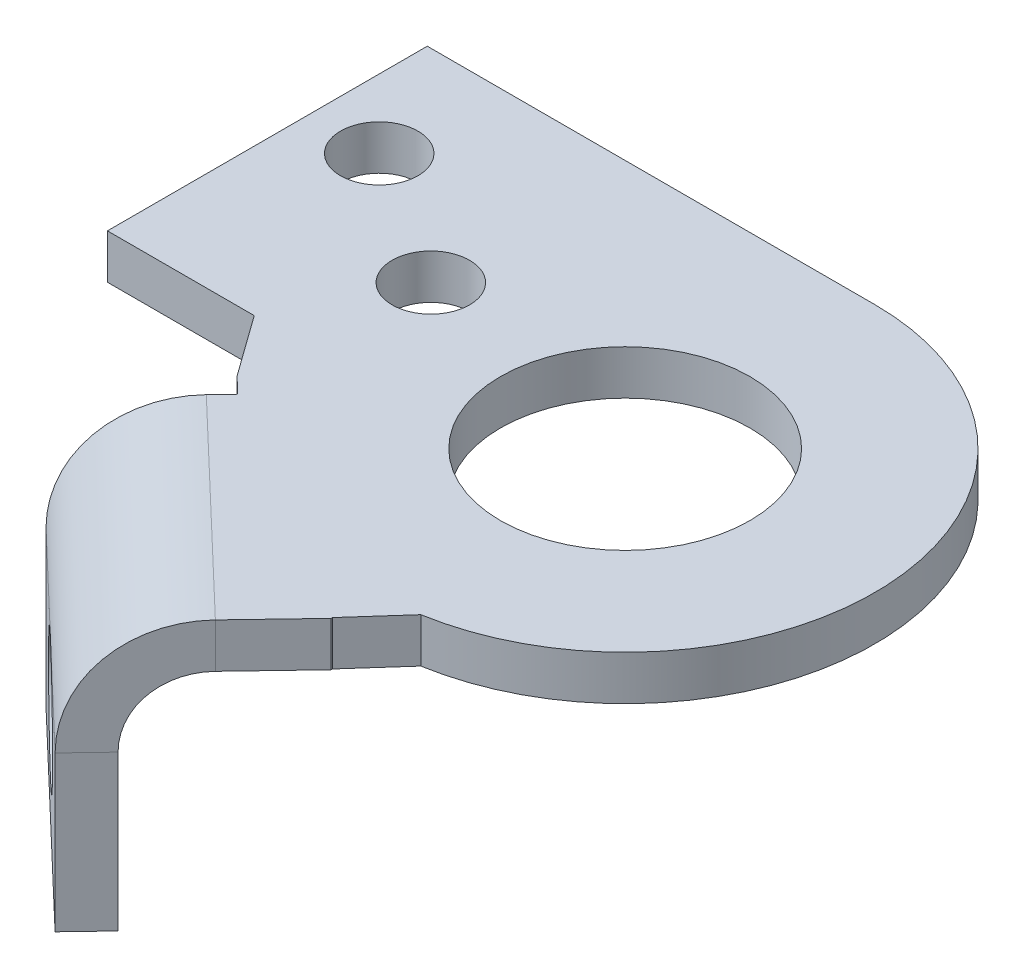
ISO-10303-21;
HEADER;
FILE_DESCRIPTION(('STEP AP214'),'2;1');
FILE_NAME('part.step','',(''),(''),'','','');
FILE_SCHEMA(('AUTOMOTIVE_DESIGN { 1 0 10303 214 1 1 1 1 }'));
ENDSEC;
DATA;
#1=APPLICATION_CONTEXT('core data for automotive mechanical design processes');
#2=APPLICATION_PROTOCOL_DEFINITION('international standard','automotive_design',2000,#1);
#3=PRODUCT_CONTEXT('',#1,'mechanical');
#4=PRODUCT('Part','Part','',(#3));
#5=PRODUCT_RELATED_PRODUCT_CATEGORY('part','',(#4));
#6=PRODUCT_DEFINITION_FORMATION('','',#4);
#7=PRODUCT_DEFINITION_CONTEXT('part definition',#1,'design');
#8=PRODUCT_DEFINITION('design','',#6,#7);
#9=PRODUCT_DEFINITION_SHAPE('','',#8);
#10=(LENGTH_UNIT() NAMED_UNIT(*) SI_UNIT(.MILLI.,.METRE.));
#11=(NAMED_UNIT(*) PLANE_ANGLE_UNIT() SI_UNIT($,.RADIAN.));
#12=(NAMED_UNIT(*) SI_UNIT($,.STERADIAN.) SOLID_ANGLE_UNIT());
#13=UNCERTAINTY_MEASURE_WITH_UNIT(LENGTH_MEASURE(1.E-05),#10,'distance_accuracy_value','');
#14=(GEOMETRIC_REPRESENTATION_CONTEXT(3) GLOBAL_UNCERTAINTY_ASSIGNED_CONTEXT((#13)) GLOBAL_UNIT_ASSIGNED_CONTEXT((#10,
#11,#12)) REPRESENTATION_CONTEXT('',''));
#15=CARTESIAN_POINT('',(0.,0.,0.));
#16=DIRECTION('',(0.,0.,1.));
#17=DIRECTION('',(1.,0.,0.));
#18=AXIS2_PLACEMENT_3D('',#15,#16,#17);
#19=CARTESIAN_POINT('',(-14.9268849894224,0.,7.62861644467929));
#20=DIRECTION('',(-0.690458508800279,0.,0.723371998093163));
#21=DIRECTION('',(0.723371998093163,0.,0.690458508800279));
#22=AXIS2_PLACEMENT_3D('',#19,#20,#21);
#23=PLANE('',#22);
#24=DIRECTION('',(0.723371998093163,0.,0.690458508800279));
#25=VECTOR('',#24,1.);
#26=CARTESIAN_POINT('',(-10.926314141485,2.588,11.4471609685178));
#27=LINE('',#26,#25);
#28=CARTESIAN_POINT('',(-14.9268849894224,2.588,7.62861644467929));
#29=VERTEX_POINT('',#28);
#30=CARTESIAN_POINT('',(-13.9908416238899,2.588,8.52206975506685));
#31=VERTEX_POINT('',#30);
#32=EDGE_CURVE('E216',#29,#31,#27,.T.);
#33=ORIENTED_EDGE('',*,*,#32,.F.);
#34=DIRECTION('',(0.,1.,0.));
#35=VECTOR('',#34,1.);
#36=CARTESIAN_POINT('',(-14.9268849894224,0.,7.62861644467929));
#37=LINE('',#36,#35);
#38=CARTESIAN_POINT('',(-14.9268849894224,0.,7.62861644467929));
#39=VERTEX_POINT('',#38);
#40=EDGE_CURVE('E324',#39,#29,#37,.T.);
#41=ORIENTED_EDGE('',*,*,#40,.F.);
#42=DIRECTION('',(0.723371998093163,0.,0.690458508800279));
#43=VECTOR('',#42,1.);
#44=CARTESIAN_POINT('',(-14.9268849894224,0.,7.62861644467929));
#45=LINE('',#44,#43);
#46=CARTESIAN_POINT('',(-13.9908416238899,0.,8.52206975506685));
#47=VERTEX_POINT('',#46);
#48=EDGE_CURVE('E321',#39,#47,#45,.T.);
#49=ORIENTED_EDGE('',*,*,#48,.T.);
#50=DIRECTION('',(0.,1.,0.));
#51=VECTOR('',#50,1.);
#52=CARTESIAN_POINT('',(-13.9908416238899,0.,8.52206975506685));
#53=LINE('',#52,#51);
#54=EDGE_CURVE('E328',#47,#31,#53,.T.);
#55=ORIENTED_EDGE('',*,*,#54,.T.);
#56=EDGE_LOOP('',(#33,#41,#49,#55));
#57=FACE_BOUND('',#56,.T.);
#58=ADVANCED_FACE('F61',(#57),#23,.T.);
#59=CARTESIAN_POINT('',(-13.9908416238899,0.,8.52206975506685));
#60=DIRECTION('',(-0.723371998093163,0.,-0.690458508800279));
#61=DIRECTION('',(-0.690458508800279,0.,0.723371998093163));
#62=AXIS2_PLACEMENT_3D('',#59,#60,#61);
#63=PLANE('',#62);
#64=DIRECTION('',(-0.690458508800279,0.,0.723371998093163));
#65=VECTOR('',#64,1.);
#66=CARTESIAN_POINT('',(-3.06452748240491,2.588,-2.92509121345095));
#67=LINE('',#66,#65);
#68=CARTESIAN_POINT('',(-14.8842949342774,2.58799999999998,9.45811312059941));
#69=VERTEX_POINT('',#68);
#70=EDGE_CURVE('E213',#31,#69,#67,.T.);
#71=ORIENTED_EDGE('',*,*,#70,.F.);
#72=ORIENTED_EDGE('',*,*,#54,.F.);
#73=DIRECTION('',(-0.690458508800279,0.,0.723371998093163));
#74=VECTOR('',#73,1.);
#75=CARTESIAN_POINT('',(-13.9908416238899,0.,8.52206975506685));
#76=LINE('',#75,#74);
#77=CARTESIAN_POINT('',(-14.8842949342774,0.,9.45811312059941));
#78=VERTEX_POINT('',#77);
#79=EDGE_CURVE('E325',#47,#78,#76,.T.);
#80=ORIENTED_EDGE('',*,*,#79,.T.);
#81=DIRECTION('',(0.,1.,0.));
#82=VECTOR('',#81,1.);
#83=CARTESIAN_POINT('',(-14.8842949342774,0.,9.45811312059941));
#84=LINE('',#83,#82);
#85=EDGE_CURVE('E305',#78,#69,#84,.T.);
#86=ORIENTED_EDGE('',*,*,#85,.T.);
#87=EDGE_LOOP('',(#71,#72,#80,#86));
#88=FACE_BOUND('',#87,.T.);
#89=ADVANCED_FACE('F347',(#88),#63,.T.);
#90=CARTESIAN_POINT('',(-3.2840455781067,0.,20.530550114686));
#91=DIRECTION('',(0.723371998093163,0.,0.690458508800279));
#92=DIRECTION('',(0.690458508800279,0.,-0.723371998093163));
#93=AXIS2_PLACEMENT_3D('',#90,#91,#92);
#94=PLANE('',#93);
#95=DIRECTION('',(0.,1.,0.));
#96=VECTOR('',#95,1.);
#97=CARTESIAN_POINT('',(0.,-13.,17.0899572602481));
#98=LINE('',#97,#96);
#99=CARTESIAN_POINT('',(0.,0.,17.0899572602481));
#100=VERTEX_POINT('',#99);
#101=CARTESIAN_POINT('',(0.,2.588,17.0899572602481));
#102=VERTEX_POINT('',#101);
#103=EDGE_CURVE('E254',#100,#102,#98,.T.);
#104=ORIENTED_EDGE('',*,*,#103,.T.);
#105=DIRECTION('',(0.690458508800279,0.,-0.723371998093163));
#106=VECTOR('',#105,1.);
#107=CARTESIAN_POINT('',(8.53572187376583,2.588,8.1473457806356));
#108=LINE('',#107,#106);
#109=CARTESIAN_POINT('',(-3.2840455781067,2.588,20.530550114686));
#110=VERTEX_POINT('',#109);
#111=EDGE_CURVE('E210',#110,#102,#108,.T.);
#112=ORIENTED_EDGE('',*,*,#111,.F.);
#113=DIRECTION('',(0.,1.,0.));
#114=VECTOR('',#113,1.);
#115=CARTESIAN_POINT('',(-3.2840455781067,0.,20.530550114686));
#116=LINE('',#115,#114);
#117=CARTESIAN_POINT('',(-3.2840455781067,0.,20.530550114686));
#118=VERTEX_POINT('',#117);
#119=EDGE_CURVE('E315',#118,#110,#116,.T.);
#120=ORIENTED_EDGE('',*,*,#119,.F.);
#121=DIRECTION('',(0.690458508800279,0.,-0.723371998093163));
#122=VECTOR('',#121,1.);
#123=CARTESIAN_POINT('',(-3.2840455781067,0.,20.530550114686));
#124=LINE('',#123,#122);
#125=EDGE_CURVE('E318',#118,#100,#124,.T.);
#126=ORIENTED_EDGE('',*,*,#125,.T.);
#127=EDGE_LOOP('',(#104,#112,#120,#126));
#128=FACE_BOUND('',#127,.T.);
#129=ADVANCED_FACE('F381',(#128),#94,.T.);
#130=CARTESIAN_POINT('',(0.,0.,0.));
#131=DIRECTION('',(0.,1.,0.));
#132=DIRECTION('',(0.,0.,1.));
#133=AXIS2_PLACEMENT_3D('',#130,#131,#132);
#134=PLANE('',#133);
#135=CARTESIAN_POINT('',(0.,0.,0.));
#136=DIRECTION('',(0.,1.,0.));
#137=DIRECTION('',(0.,0.,1.));
#138=AXIS2_PLACEMENT_3D('',#135,#136,#137);
#139=CIRCLE('',#138,7.25);
#140=CARTESIAN_POINT('',(0.,0.,7.25));
#141=VERTEX_POINT('',#140);
#142=EDGE_CURVE('E234',#141,#141,#139,.T.);
#143=ORIENTED_EDGE('',*,*,#142,.T.);
#144=EDGE_LOOP('',(#143));
#145=FACE_BOUND('',#144,.T.);
#146=DIRECTION('',(1.,0.,0.));
#147=VECTOR('',#146,1.);
#148=CARTESIAN_POINT('',(0.,0.,4.086));
#149=LINE('',#148,#147);
#150=CARTESIAN_POINT('',(-26.,0.,4.086));
#151=VERTEX_POINT('',#150);
#152=CARTESIAN_POINT('',(-17.4700945052539,0.,4.086));
#153=VERTEX_POINT('',#152);
#154=EDGE_CURVE('E211',#151,#153,#149,.T.);
#155=ORIENTED_EDGE('',*,*,#154,.F.);
#156=DIRECTION('',(0.,0.,-1.));
#157=VECTOR('',#156,1.);
#158=CARTESIAN_POINT('',(-26.,0.,0.));
#159=LINE('',#158,#157);
#160=CARTESIAN_POINT('',(-26.,0.,-14.5));
#161=VERTEX_POINT('',#160);
#162=EDGE_CURVE('E175',#151,#161,#159,.T.);
#163=ORIENTED_EDGE('',*,*,#162,.T.);
#164=DIRECTION('',(-1.,0.,0.));
#165=VECTOR('',#164,1.);
#166=CARTESIAN_POINT('',(0.,0.,-14.5));
#167=LINE('',#166,#165);
#168=CARTESIAN_POINT('',(0.,0.,-14.5));
#169=VERTEX_POINT('',#168);
#170=EDGE_CURVE('E195',#169,#161,#167,.T.);
#171=ORIENTED_EDGE('',*,*,#170,.F.);
#172=CARTESIAN_POINT('',(0.,0.,0.));
#173=DIRECTION('',(0.,1.,0.));
#174=DIRECTION('',(0.,0.,1.));
#175=AXIS2_PLACEMENT_3D('',#172,#173,#174);
#176=CIRCLE('',#175,14.5);
#177=CARTESIAN_POINT('',(2.42132895642929,0.,14.2964039564066));
#178=VERTEX_POINT('',#177);
#179=EDGE_CURVE('E199',#178,#169,#176,.T.);
#180=ORIENTED_EDGE('',*,*,#179,.F.);
#181=DIRECTION('',(-0.665811178859835,0.,0.74612028125851));
#182=VECTOR('',#181,1.);
#183=CARTESIAN_POINT('',(-1.09894578486608,0.,18.2412887277622));
#184=LINE('',#183,#182);
#185=CARTESIAN_POINT('',(0.,0.,17.0097898221772));
#186=VERTEX_POINT('',#185);
#187=EDGE_CURVE('E231',#178,#186,#184,.T.);
#188=ORIENTED_EDGE('',*,*,#187,.T.);
#189=DIRECTION('',(0.,0.,-1.));
#190=VECTOR('',#189,1.);
#191=CARTESIAN_POINT('',(0.,0.,0.));
#192=LINE('',#191,#190);
#193=EDGE_CURVE('E334',#100,#186,#192,.T.);
#194=ORIENTED_EDGE('',*,*,#193,.F.);
#195=ORIENTED_EDGE('',*,*,#125,.F.);
#196=DIRECTION('',(-0.723371998093163,0.,-0.690458508800279));
#197=VECTOR('',#196,1.);
#198=CARTESIAN_POINT('',(-14.8842949342775,0.,9.45811312059939));
#199=LINE('',#198,#197);
#200=EDGE_CURVE('E311',#78,#118,#199,.F.);
#201=ORIENTED_EDGE('',*,*,#200,.F.);
#202=ORIENTED_EDGE('',*,*,#79,.F.);
#203=ORIENTED_EDGE('',*,*,#48,.F.);
#204=DIRECTION('',(-0.58317539755898,0.,-0.812346265875535));
#205=VECTOR('',#204,1.);
#206=CARTESIAN_POINT('',(-13.4643312422844,0.,9.66591102209617));
#207=LINE('',#206,#205);
#208=EDGE_CURVE('E258',#39,#153,#207,.T.);
#209=ORIENTED_EDGE('',*,*,#208,.T.);
#210=EDGE_LOOP('',(#155,#163,#171,#180,#188,#194,#195,#201,#202,#203,#209));
#211=FACE_BOUND('',#210,.T.);
#212=CARTESIAN_POINT('',(-22.,0.,-7.707));
#213=DIRECTION('',(0.,1.,0.));
#214=DIRECTION('',(0.,0.,1.));
#215=AXIS2_PLACEMENT_3D('',#212,#213,#214);
#216=CIRCLE('',#215,2.24999999999999);
#217=CARTESIAN_POINT('',(-22.,0.,-5.45700000000001));
#218=VERTEX_POINT('',#217);
#219=EDGE_CURVE('E245',#218,#218,#216,.T.);
#220=ORIENTED_EDGE('',*,*,#219,.T.);
#221=EDGE_LOOP('',(#220));
#222=FACE_BOUND('',#221,.T.);
#223=CARTESIAN_POINT('',(-14.,0.,-2.707));
#224=DIRECTION('',(0.,1.,0.));
#225=DIRECTION('',(0.,0.,1.));
#226=AXIS2_PLACEMENT_3D('',#223,#224,#225);
#227=CIRCLE('',#226,2.24999999999999);
#228=CARTESIAN_POINT('',(-14.,0.,-0.457000000000005));
#229=VERTEX_POINT('',#228);
#230=EDGE_CURVE('E251',#229,#229,#227,.T.);
#231=ORIENTED_EDGE('',*,*,#230,.T.);
#232=EDGE_LOOP('',(#231));
#233=FACE_BOUND('',#232,.T.);
#234=ADVANCED_FACE('F340',(#145,#211,#222,#233),#134,.F.);
#235=CARTESIAN_POINT('',(0.,2.588,0.));
#236=DIRECTION('',(0.,1.,0.));
#237=DIRECTION('',(0.,0.,1.));
#238=AXIS2_PLACEMENT_3D('',#235,#236,#237);
#239=PLANE('',#238);
#240=DIRECTION('',(0.,0.,-1.));
#241=VECTOR('',#240,1.);
#242=CARTESIAN_POINT('',(-26.,2.588,5.41961724591726));
#243=LINE('',#242,#241);
#244=CARTESIAN_POINT('',(-26.,2.588,4.086));
#245=VERTEX_POINT('',#244);
#246=CARTESIAN_POINT('',(-26.,2.588,-14.5));
#247=VERTEX_POINT('',#246);
#248=EDGE_CURVE('E75',#245,#247,#243,.T.);
#249=ORIENTED_EDGE('',*,*,#248,.F.);
#250=DIRECTION('',(1.,0.,0.));
#251=VECTOR('',#250,1.);
#252=CARTESIAN_POINT('',(0.,2.588,4.086));
#253=LINE('',#252,#251);
#254=CARTESIAN_POINT('',(-17.4700945052539,2.588,4.086));
#255=VERTEX_POINT('',#254);
#256=EDGE_CURVE('E186',#245,#255,#253,.T.);
#257=ORIENTED_EDGE('',*,*,#256,.T.);
#258=DIRECTION('',(-0.58317539755898,0.,-0.812346265875535));
#259=VECTOR('',#258,1.);
#260=CARTESIAN_POINT('',(-14.9268849894224,2.588,7.62861644467929));
#261=LINE('',#260,#259);
#262=EDGE_CURVE('E255',#29,#255,#261,.T.);
#263=ORIENTED_EDGE('',*,*,#262,.F.);
#264=ORIENTED_EDGE('',*,*,#32,.T.);
#265=ORIENTED_EDGE('',*,*,#70,.T.);
#266=DIRECTION('',(-0.723371998093163,0.,-0.690458508800279));
#267=VECTOR('',#266,1.);
#268=CARTESIAN_POINT('',(-14.8842949342775,2.58799999999998,9.45811312059939));
#269=LINE('',#268,#267);
#270=EDGE_CURVE('E298',#69,#110,#269,.F.);
#271=ORIENTED_EDGE('',*,*,#270,.T.);
#272=ORIENTED_EDGE('',*,*,#111,.T.);
#273=DIRECTION('',(0.,0.,1.));
#274=VECTOR('',#273,1.);
#275=CARTESIAN_POINT('',(0.,2.588,0.));
#276=LINE('',#275,#274);
#277=CARTESIAN_POINT('',(0.,2.588,17.0097898221772));
#278=VERTEX_POINT('',#277);
#279=EDGE_CURVE('E196',#102,#278,#276,.F.);
#280=ORIENTED_EDGE('',*,*,#279,.T.);
#281=DIRECTION('',(0.665811178859834,0.,-0.746120281258509));
#282=VECTOR('',#281,1.);
#283=CARTESIAN_POINT('',(-1.09894578486608,2.588,18.2412887277622));
#284=LINE('',#283,#282);
#285=CARTESIAN_POINT('',(2.42132895642928,2.588,14.2964039564066));
#286=VERTEX_POINT('',#285);
#287=EDGE_CURVE('E229',#278,#286,#284,.T.);
#288=ORIENTED_EDGE('',*,*,#287,.T.);
#289=CARTESIAN_POINT('',(0.,2.588,0.));
#290=DIRECTION('',(0.,1.,0.));
#291=DIRECTION('',(0.,0.,1.));
#292=AXIS2_PLACEMENT_3D('',#289,#290,#291);
#293=CIRCLE('',#292,14.5);
#294=CARTESIAN_POINT('',(0.,2.588,-14.5));
#295=VERTEX_POINT('',#294);
#296=EDGE_CURVE('E201',#286,#295,#293,.T.);
#297=ORIENTED_EDGE('',*,*,#296,.T.);
#298=DIRECTION('',(1.,0.,0.));
#299=VECTOR('',#298,1.);
#300=CARTESIAN_POINT('',(0.,2.588,-14.5));
#301=LINE('',#300,#299);
#302=EDGE_CURVE('E189',#295,#247,#301,.F.);
#303=ORIENTED_EDGE('',*,*,#302,.T.);
#304=EDGE_LOOP('',(#249,#257,#263,#264,#265,#271,#272,#280,#288,#297,#303));
#305=FACE_BOUND('',#304,.T.);
#306=CARTESIAN_POINT('',(0.,2.588,0.));
#307=DIRECTION('',(0.,1.,0.));
#308=DIRECTION('',(0.,0.,1.));
#309=AXIS2_PLACEMENT_3D('',#306,#307,#308);
#310=CIRCLE('',#309,7.25);
#311=CARTESIAN_POINT('',(0.,2.588,7.25));
#312=VERTEX_POINT('',#311);
#313=EDGE_CURVE('E179',#312,#312,#310,.T.);
#314=ORIENTED_EDGE('',*,*,#313,.F.);
#315=EDGE_LOOP('',(#314));
#316=FACE_BOUND('',#315,.T.);
#317=CARTESIAN_POINT('',(-22.,2.588,-7.707));
#318=DIRECTION('',(0.,1.,0.));
#319=DIRECTION('',(0.,0.,1.));
#320=AXIS2_PLACEMENT_3D('',#317,#318,#319);
#321=CIRCLE('',#320,2.24999999999999);
#322=CARTESIAN_POINT('',(-22.,2.588,-5.45700000000001));
#323=VERTEX_POINT('',#322);
#324=EDGE_CURVE('E242',#323,#323,#321,.T.);
#325=ORIENTED_EDGE('',*,*,#324,.F.);
#326=EDGE_LOOP('',(#325));
#327=FACE_BOUND('',#326,.T.);
#328=CARTESIAN_POINT('',(-14.,2.588,-2.707));
#329=DIRECTION('',(0.,1.,0.));
#330=DIRECTION('',(0.,0.,1.));
#331=AXIS2_PLACEMENT_3D('',#328,#329,#330);
#332=CIRCLE('',#331,2.24999999999999);
#333=CARTESIAN_POINT('',(-14.,2.588,-0.45700000000001));
#334=VERTEX_POINT('',#333);
#335=EDGE_CURVE('E248',#334,#334,#332,.T.);
#336=ORIENTED_EDGE('',*,*,#335,.F.);
#337=EDGE_LOOP('',(#336));
#338=FACE_BOUND('',#337,.T.);
#339=ADVANCED_FACE('F183',(#305,#316,#327,#338),#239,.T.);
#340=CARTESIAN_POINT('',(0.,0.,0.));
#341=DIRECTION('',(1.,0.,0.));
#342=DIRECTION('',(0.,0.,-1.));
#343=AXIS2_PLACEMENT_3D('',#340,#341,#342);
#344=PLANE('',#343);
#345=DIRECTION('',(0.,-1.,0.));
#346=VECTOR('',#345,1.);
#347=CARTESIAN_POINT('',(0.,0.,17.0097898221772));
#348=LINE('',#347,#346);
#349=EDGE_CURVE('E83',#278,#186,#348,.T.);
#350=ORIENTED_EDGE('',*,*,#349,.F.);
#351=ORIENTED_EDGE('',*,*,#279,.F.);
#352=ORIENTED_EDGE('',*,*,#103,.F.);
#353=ORIENTED_EDGE('',*,*,#193,.T.);
#354=EDGE_LOOP('',(#350,#351,#352,#353));
#355=FACE_BOUND('',#354,.T.);
#356=ADVANCED_FACE('F384',(#355),#344,.T.);
#357=CARTESIAN_POINT('',(0.,0.,4.086));
#358=DIRECTION('',(0.,0.,1.));
#359=DIRECTION('',(1.,0.,0.));
#360=AXIS2_PLACEMENT_3D('',#357,#358,#359);
#361=PLANE('',#360);
#362=DIRECTION('',(0.,1.,0.));
#363=VECTOR('',#362,1.);
#364=CARTESIAN_POINT('',(-26.,0.,4.086));
#365=LINE('',#364,#363);
#366=EDGE_CURVE('E172',#151,#245,#365,.T.);
#367=ORIENTED_EDGE('',*,*,#366,.F.);
#368=ORIENTED_EDGE('',*,*,#154,.T.);
#369=DIRECTION('',(0.,1.,0.));
#370=VECTOR('',#369,1.);
#371=CARTESIAN_POINT('',(-17.4700945052539,-13.,4.086));
#372=LINE('',#371,#370);
#373=EDGE_CURVE('E193',#153,#255,#372,.T.);
#374=ORIENTED_EDGE('',*,*,#373,.T.);
#375=ORIENTED_EDGE('',*,*,#256,.F.);
#376=EDGE_LOOP('',(#367,#368,#374,#375));
#377=FACE_BOUND('',#376,.T.);
#378=ADVANCED_FACE('F191',(#377),#361,.T.);
#379=CARTESIAN_POINT('',(0.,0.,-14.5));
#380=DIRECTION('',(0.,0.,-1.));
#381=DIRECTION('',(-1.,0.,0.));
#382=AXIS2_PLACEMENT_3D('',#379,#380,#381);
#383=PLANE('',#382);
#384=DIRECTION('',(0.,-1.,0.));
#385=VECTOR('',#384,1.);
#386=CARTESIAN_POINT('',(-26.,0.,-14.5));
#387=LINE('',#386,#385);
#388=EDGE_CURVE('E13',#247,#161,#387,.T.);
#389=ORIENTED_EDGE('',*,*,#388,.F.);
#390=ORIENTED_EDGE('',*,*,#302,.F.);
#391=DIRECTION('',(0.,-1.,0.));
#392=VECTOR('',#391,1.);
#393=CARTESIAN_POINT('',(0.,0.,-14.5));
#394=LINE('',#393,#392);
#395=EDGE_CURVE('E207',#295,#169,#394,.T.);
#396=ORIENTED_EDGE('',*,*,#395,.T.);
#397=ORIENTED_EDGE('',*,*,#170,.T.);
#398=EDGE_LOOP('',(#389,#390,#396,#397));
#399=FACE_BOUND('',#398,.T.);
#400=ADVANCED_FACE('F390',(#399),#383,.T.);
#401=CARTESIAN_POINT('',(0.,0.,0.));
#402=DIRECTION('',(0.,1.,0.));
#403=DIRECTION('',(0.,0.,1.));
#404=AXIS2_PLACEMENT_3D('',#401,#402,#403);
#405=CYLINDRICAL_SURFACE('',#404,14.5);
#406=DIRECTION('',(0.,1.,0.));
#407=VECTOR('',#406,1.);
#408=CARTESIAN_POINT('',(2.42132895642929,0.,14.2964039564066));
#409=LINE('',#408,#407);
#410=EDGE_CURVE('E69',#178,#286,#409,.T.);
#411=ORIENTED_EDGE('',*,*,#410,.F.);
#412=ORIENTED_EDGE('',*,*,#179,.T.);
#413=ORIENTED_EDGE('',*,*,#395,.F.);
#414=ORIENTED_EDGE('',*,*,#296,.F.);
#415=EDGE_LOOP('',(#411,#412,#413,#414));
#416=FACE_BOUND('',#415,.T.);
#417=ADVANCED_FACE('F63',(#416),#405,.T.);
#418=CARTESIAN_POINT('',(-3.2840455781067,-4.,20.530550114686));
#419=DIRECTION('',(0.723371998093163,0.,0.690458508800279));
#420=DIRECTION('',(0.690458508800279,0.,-0.723371998093163));
#421=AXIS2_PLACEMENT_3D('',#418,#419,#420);
#422=PLANE('',#421);
#423=DIRECTION('',(0.690458508800279,0.,-0.723371998093163));
#424=VECTOR('',#423,1.);
#425=CARTESIAN_POINT('',(-7.83278623408294,-3.99999999999998,25.2961248381237));
#426=LINE('',#425,#424);
#427=CARTESIAN_POINT('',(-6.04587961330781,-3.99999999999999,23.4240381070586));
#428=VERTEX_POINT('',#427);
#429=CARTESIAN_POINT('',(-7.83278623408293,-3.99999999999998,25.2961248381237));
#430=VERTEX_POINT('',#429);
#431=EDGE_CURVE('E220',#428,#430,#426,.F.);
#432=ORIENTED_EDGE('',*,*,#431,.F.);
#433=CARTESIAN_POINT('',(-3.2840455781067,-4.,20.530550114686));
#434=DIRECTION('',(-0.723371998093163,0.,-0.690458508800279));
#435=DIRECTION('',(-0.690458508800279,0.,0.723371998093163));
#436=AXIS2_PLACEMENT_3D('',#433,#434,#435);
#437=CIRCLE('',#436,3.99999999999999);
#438=EDGE_CURVE('E308',#118,#428,#437,.F.);
#439=ORIENTED_EDGE('',*,*,#438,.F.);
#440=ORIENTED_EDGE('',*,*,#119,.T.);
#441=CARTESIAN_POINT('',(-3.2840455781067,-4.,20.530550114686));
#442=DIRECTION('',(-0.723371998093163,0.,-0.690458508800279));
#443=DIRECTION('',(-0.690458508800279,0.,0.723371998093163));
#444=AXIS2_PLACEMENT_3D('',#441,#442,#443);
#445=CIRCLE('',#444,6.58799999999999);
#446=EDGE_CURVE('E301',#110,#430,#445,.F.);
#447=ORIENTED_EDGE('',*,*,#446,.T.);
#448=EDGE_LOOP('',(#432,#439,#440,#447));
#449=FACE_BOUND('',#448,.T.);
#450=ADVANCED_FACE('F378',(#449),#422,.T.);
#451=CARTESIAN_POINT('',(-14.8842949342774,-4.,9.45811312059941));
#452=DIRECTION('',(0.723371998093163,0.,0.690458508800279));
#453=DIRECTION('',(0.690458508800279,0.,-0.723371998093163));
#454=AXIS2_PLACEMENT_3D('',#451,#452,#453);
#455=PLANE('',#454);
#456=CARTESIAN_POINT('',(-14.8842949342774,-4.,9.45811312059941));
#457=DIRECTION('',(-0.723371998093163,0.,-0.690458508800279));
#458=DIRECTION('',(-0.690458508800279,0.,0.723371998093163));
#459=AXIS2_PLACEMENT_3D('',#456,#457,#458);
#460=CIRCLE('',#459,3.99999999999999);
#461=CARTESIAN_POINT('',(-17.6461289694785,-3.99999999999999,12.3516011129721));
#462=VERTEX_POINT('',#461);
#463=EDGE_CURVE('E267',#462,#78,#460,.T.);
#464=ORIENTED_EDGE('',*,*,#463,.F.);
#465=DIRECTION('',(0.690458508800279,0.,-0.723371998093163));
#466=VECTOR('',#465,1.);
#467=CARTESIAN_POINT('',(-17.6461289694786,-3.99999999999999,12.3516011129721));
#468=LINE('',#467,#466);
#469=CARTESIAN_POINT('',(-19.4330355902537,-3.99999999999998,14.2236878440372));
#470=VERTEX_POINT('',#469);
#471=EDGE_CURVE('E289',#462,#470,#468,.F.);
#472=ORIENTED_EDGE('',*,*,#471,.T.);
#473=CARTESIAN_POINT('',(-14.8842949342774,-4.,9.45811312059941));
#474=DIRECTION('',(-0.723371998093163,0.,-0.690458508800279));
#475=DIRECTION('',(-0.690458508800279,0.,0.723371998093163));
#476=AXIS2_PLACEMENT_3D('',#473,#474,#475);
#477=CIRCLE('',#476,6.58799999999999);
#478=EDGE_CURVE('E302',#470,#69,#477,.T.);
#479=ORIENTED_EDGE('',*,*,#478,.T.);
#480=ORIENTED_EDGE('',*,*,#85,.F.);
#481=EDGE_LOOP('',(#464,#472,#479,#480));
#482=FACE_BOUND('',#481,.T.);
#483=ADVANCED_FACE('F350',(#482),#455,.F.);
#484=CARTESIAN_POINT('',(-14.8842949342775,-4.,9.4581131205994));
#485=DIRECTION('',(-0.723371998093163,0.,-0.690458508800279));
#486=DIRECTION('',(-0.690458508800279,0.,0.723371998093163));
#487=AXIS2_PLACEMENT_3D('',#484,#485,#486);
#488=CYLINDRICAL_SURFACE('',#487,6.58799999999999);
#489=ORIENTED_EDGE('',*,*,#270,.F.);
#490=ORIENTED_EDGE('',*,*,#478,.F.);
#491=DIRECTION('',(-0.723371998093163,0.,-0.690458508800279));
#492=VECTOR('',#491,1.);
#493=CARTESIAN_POINT('',(-7.83278623408294,-3.99999999999998,25.2961248381237));
#494=LINE('',#493,#492);
#495=CARTESIAN_POINT('',(-13.6329109121683,-3.99999999999998,19.7599063410804));
#496=VERTEX_POINT('',#495);
#497=EDGE_CURVE('E285',#470,#496,#494,.F.);
#498=ORIENTED_EDGE('',*,*,#497,.T.);
#499=EDGE_CURVE('E288',#496,#430,#494,.F.);
#500=ORIENTED_EDGE('',*,*,#499,.T.);
#501=ORIENTED_EDGE('',*,*,#446,.F.);
#502=EDGE_LOOP('',(#489,#490,#498,#500,#501));
#503=FACE_BOUND('',#502,.T.);
#504=ADVANCED_FACE('F374',(#503),#488,.T.);
#505=CARTESIAN_POINT('',(-14.8842949342775,-4.,9.4581131205994));
#506=DIRECTION('',(-0.723371998093163,0.,-0.690458508800279));
#507=DIRECTION('',(-0.690458508800279,0.,0.723371998093163));
#508=AXIS2_PLACEMENT_3D('',#505,#506,#507);
#509=CYLINDRICAL_SURFACE('',#508,3.99999999999999);
#510=ORIENTED_EDGE('',*,*,#200,.T.);
#511=ORIENTED_EDGE('',*,*,#438,.T.);
#512=DIRECTION('',(-0.723371998093163,0.,-0.690458508800279));
#513=VECTOR('',#512,1.);
#514=CARTESIAN_POINT('',(-6.04587961330781,-3.99999999999999,23.4240381070586));
#515=LINE('',#514,#513);
#516=CARTESIAN_POINT('',(-11.8460042913932,-3.99999999999999,17.8878196100153));
#517=VERTEX_POINT('',#516);
#518=EDGE_CURVE('E292',#428,#517,#515,.T.);
#519=ORIENTED_EDGE('',*,*,#518,.T.);
#520=EDGE_CURVE('E295',#517,#462,#515,.T.);
#521=ORIENTED_EDGE('',*,*,#520,.T.);
#522=ORIENTED_EDGE('',*,*,#463,.T.);
#523=EDGE_LOOP('',(#510,#511,#519,#521,#522));
#524=FACE_BOUND('',#523,.T.);
#525=ADVANCED_FACE('F353',(#524),#509,.F.);
#526=CARTESIAN_POINT('',(-19.4330355902537,-13.,14.2236878440372));
#527=DIRECTION('',(0.723371998093163,0.,0.690458508800279));
#528=DIRECTION('',(0.690458508800279,0.,-0.723371998093163));
#529=AXIS2_PLACEMENT_3D('',#526,#527,#528);
#530=PLANE('',#529);
#531=ORIENTED_EDGE('',*,*,#471,.F.);
#532=DIRECTION('',(0.,1.,0.));
#533=VECTOR('',#532,1.);
#534=CARTESIAN_POINT('',(-17.6461289694786,-13.,12.3516011129721));
#535=LINE('',#534,#533);
#536=CARTESIAN_POINT('',(-17.6461289694786,-13.,12.3516011129721));
#537=VERTEX_POINT('',#536);
#538=EDGE_CURVE('E283',#462,#537,#535,.F.);
#539=ORIENTED_EDGE('',*,*,#538,.T.);
#540=DIRECTION('',(0.690458508800279,0.,-0.723371998093163));
#541=VECTOR('',#540,1.);
#542=CARTESIAN_POINT('',(-19.4330355902537,-13.,14.2236878440372));
#543=LINE('',#542,#541);
#544=CARTESIAN_POINT('',(-19.4330355902537,-13.,14.2236878440372));
#545=VERTEX_POINT('',#544);
#546=EDGE_CURVE('E264',#545,#537,#543,.T.);
#547=ORIENTED_EDGE('',*,*,#546,.F.);
#548=DIRECTION('',(0.,-1.,0.));
#549=VECTOR('',#548,1.);
#550=CARTESIAN_POINT('',(-19.4330355902537,0.,14.2236878440372));
#551=LINE('',#550,#549);
#552=EDGE_CURVE('E276',#470,#545,#551,.T.);
#553=ORIENTED_EDGE('',*,*,#552,.F.);
#554=EDGE_LOOP('',(#531,#539,#547,#553));
#555=FACE_BOUND('',#554,.T.);
#556=ADVANCED_FACE('F365',(#555),#530,.F.);
#557=CARTESIAN_POINT('',(-7.83278623408293,0.,25.2961248381237));
#558=DIRECTION('',(-0.723371998093163,0.,-0.690458508800279));
#559=DIRECTION('',(-0.690458508800279,0.,0.723371998093163));
#560=AXIS2_PLACEMENT_3D('',#557,#558,#559);
#561=PLANE('',#560);
#562=ORIENTED_EDGE('',*,*,#431,.T.);
#563=DIRECTION('',(0.,1.,0.));
#564=VECTOR('',#563,1.);
#565=CARTESIAN_POINT('',(-7.83278623408293,0.,25.2961248381237));
#566=LINE('',#565,#564);
#567=CARTESIAN_POINT('',(-7.83278623408296,-13.,25.2961248381237));
#568=VERTEX_POINT('',#567);
#569=EDGE_CURVE('E271',#568,#430,#566,.T.);
#570=ORIENTED_EDGE('',*,*,#569,.F.);
#571=DIRECTION('',(0.690458508800279,0.,-0.723371998093163));
#572=VECTOR('',#571,1.);
#573=CARTESIAN_POINT('',(-7.83278623408296,-13.,25.2961248381237));
#574=LINE('',#573,#572);
#575=CARTESIAN_POINT('',(-6.04587961330784,-13.,23.4240381070586));
#576=VERTEX_POINT('',#575);
#577=EDGE_CURVE('E268',#568,#576,#574,.T.);
#578=ORIENTED_EDGE('',*,*,#577,.T.);
#579=DIRECTION('',(0.,-1.,0.));
#580=VECTOR('',#579,1.);
#581=CARTESIAN_POINT('',(-6.0458796133078,0.,23.4240381070586));
#582=LINE('',#581,#580);
#583=EDGE_CURVE('E278',#576,#428,#582,.F.);
#584=ORIENTED_EDGE('',*,*,#583,.T.);
#585=EDGE_LOOP('',(#562,#570,#578,#584));
#586=FACE_BOUND('',#585,.T.);
#587=ADVANCED_FACE('F444',(#586),#561,.F.);
#588=CARTESIAN_POINT('',(-16.3685081078488,0.,17.1487790574881));
#589=DIRECTION('',(0.690458508800279,0.,-0.723371998093163));
#590=DIRECTION('',(-0.723371998093163,0.,-0.690458508800279));
#591=AXIS2_PLACEMENT_3D('',#588,#589,#590);
#592=PLANE('',#591);
#593=ORIENTED_EDGE('',*,*,#499,.F.);
#594=CARTESIAN_POINT('',(-13.6329109121683,-7.49999999999999,19.7599063410804));
#595=DIRECTION('',(-0.690458508800279,0.,0.723371998093163));
#596=DIRECTION('',(0.723371998093163,0.,0.690458508800279));
#597=AXIS2_PLACEMENT_3D('',#594,#595,#596);
#598=CIRCLE('',#597,3.50000000000001);
#599=EDGE_CURVE('E221',#496,#496,#598,.T.);
#600=ORIENTED_EDGE('',*,*,#599,.F.);
#601=ORIENTED_EDGE('',*,*,#497,.F.);
#602=ORIENTED_EDGE('',*,*,#552,.T.);
#603=DIRECTION('',(0.723371998093163,0.,0.690458508800279));
#604=VECTOR('',#603,1.);
#605=CARTESIAN_POINT('',(-16.3685081078488,-13.,17.1487790574881));
#606=LINE('',#605,#604);
#607=EDGE_CURVE('E274',#545,#568,#606,.T.);
#608=ORIENTED_EDGE('',*,*,#607,.T.);
#609=ORIENTED_EDGE('',*,*,#569,.T.);
#610=EDGE_LOOP('',(#593,#600,#601,#602,#608,#609));
#611=FACE_BOUND('',#610,.T.);
#612=ADVANCED_FACE('F371',(#611),#592,.F.);
#613=CARTESIAN_POINT('',(-14.5816014870736,0.,15.276692326423));
#614=DIRECTION('',(0.690458508800279,0.,-0.723371998093163));
#615=DIRECTION('',(-0.723371998093163,0.,-0.690458508800279));
#616=AXIS2_PLACEMENT_3D('',#613,#614,#615);
#617=PLANE('',#616);
#618=ORIENTED_EDGE('',*,*,#520,.F.);
#619=CARTESIAN_POINT('',(-11.8460042913932,-7.5,17.8878196100153));
#620=DIRECTION('',(0.690458508800279,0.,-0.723371998093163));
#621=DIRECTION('',(-0.723371998093163,0.,-0.690458508800279));
#622=AXIS2_PLACEMENT_3D('',#619,#620,#621);
#623=CIRCLE('',#622,3.50000000000001);
#624=EDGE_CURVE('E219',#517,#517,#623,.T.);
#625=ORIENTED_EDGE('',*,*,#624,.F.);
#626=ORIENTED_EDGE('',*,*,#518,.F.);
#627=ORIENTED_EDGE('',*,*,#583,.F.);
#628=DIRECTION('',(-0.723371998093163,0.,-0.690458508800279));
#629=VECTOR('',#628,1.);
#630=CARTESIAN_POINT('',(-6.04587961330784,-13.,23.4240381070586));
#631=LINE('',#630,#629);
#632=EDGE_CURVE('E281',#537,#576,#631,.F.);
#633=ORIENTED_EDGE('',*,*,#632,.F.);
#634=ORIENTED_EDGE('',*,*,#538,.F.);
#635=EDGE_LOOP('',(#618,#625,#626,#627,#633,#634));
#636=FACE_BOUND('',#635,.T.);
#637=ADVANCED_FACE('F360',(#636),#617,.T.);
#638=CARTESIAN_POINT('',(-7.83278623408296,-13.,25.2961248381237));
#639=DIRECTION('',(0.,1.,0.));
#640=DIRECTION('',(0.,0.,1.));
#641=AXIS2_PLACEMENT_3D('',#638,#639,#640);
#642=PLANE('',#641);
#643=ORIENTED_EDGE('',*,*,#632,.T.);
#644=ORIENTED_EDGE('',*,*,#577,.F.);
#645=ORIENTED_EDGE('',*,*,#607,.F.);
#646=ORIENTED_EDGE('',*,*,#546,.T.);
#647=EDGE_LOOP('',(#643,#644,#645,#646));
#648=FACE_BOUND('',#647,.T.);
#649=ADVANCED_FACE('F440',(#648),#642,.F.);
#650=CARTESIAN_POINT('',(16.8903710962273,-7.50000000000014,-12.2183909980881));
#651=DIRECTION('',(-0.690458508800279,0.,0.723371998093163));
#652=DIRECTION('',(0.723371998093163,0.,0.690458508800279));
#653=AXIS2_PLACEMENT_3D('',#650,#651,#652);
#654=CYLINDRICAL_SURFACE('',#653,3.50000000000001);
#655=ORIENTED_EDGE('',*,*,#624,.T.);
#656=EDGE_LOOP('',(#655));
#657=FACE_BOUND('',#656,.T.);
#658=ORIENTED_EDGE('',*,*,#599,.T.);
#659=EDGE_LOOP('',(#658));
#660=FACE_BOUND('',#659,.T.);
#661=ADVANCED_FACE('F434',(#657,#660),#654,.F.);
#662=CARTESIAN_POINT('',(-14.9268849894224,-13.,7.62861644467929));
#663=DIRECTION('',(0.812346265875535,0.,-0.58317539755898));
#664=DIRECTION('',(-0.58317539755898,0.,-0.812346265875535));
#665=AXIS2_PLACEMENT_3D('',#662,#663,#664);
#666=PLANE('',#665);
#667=ORIENTED_EDGE('',*,*,#40,.T.);
#668=ORIENTED_EDGE('',*,*,#262,.T.);
#669=ORIENTED_EDGE('',*,*,#373,.F.);
#670=ORIENTED_EDGE('',*,*,#208,.F.);
#671=EDGE_LOOP('',(#667,#668,#669,#670));
#672=FACE_BOUND('',#671,.T.);
#673=ADVANCED_FACE('F337',(#672),#666,.F.);
#674=CARTESIAN_POINT('',(-14.,2.588,-2.707));
#675=DIRECTION('',(0.,1.,0.));
#676=DIRECTION('',(0.,0.,1.));
#677=AXIS2_PLACEMENT_3D('',#674,#675,#676);
#678=CYLINDRICAL_SURFACE('',#677,2.24999999999999);
#679=ORIENTED_EDGE('',*,*,#335,.T.);
#680=EDGE_LOOP('',(#679));
#681=FACE_BOUND('',#680,.T.);
#682=ORIENTED_EDGE('',*,*,#230,.F.);
#683=EDGE_LOOP('',(#682));
#684=FACE_BOUND('',#683,.T.);
#685=ADVANCED_FACE('F421',(#681,#684),#678,.F.);
#686=CARTESIAN_POINT('',(-22.,2.588,-7.707));
#687=DIRECTION('',(0.,1.,0.));
#688=DIRECTION('',(0.,0.,1.));
#689=AXIS2_PLACEMENT_3D('',#686,#687,#688);
#690=CYLINDRICAL_SURFACE('',#689,2.24999999999999);
#691=ORIENTED_EDGE('',*,*,#324,.T.);
#692=EDGE_LOOP('',(#691));
#693=FACE_BOUND('',#692,.T.);
#694=ORIENTED_EDGE('',*,*,#219,.F.);
#695=EDGE_LOOP('',(#694));
#696=FACE_BOUND('',#695,.T.);
#697=ADVANCED_FACE('F424',(#693,#696),#690,.F.);
#698=CARTESIAN_POINT('',(-1.09894578486608,-8.57630504698584,18.2412887277622));
#699=DIRECTION('',(0.74612028125851,0.,0.665811178859835));
#700=DIRECTION('',(0.665811178859835,0.,-0.74612028125851));
#701=AXIS2_PLACEMENT_3D('',#698,#699,#700);
#702=PLANE('',#701);
#703=ORIENTED_EDGE('',*,*,#287,.F.);
#704=ORIENTED_EDGE('',*,*,#349,.T.);
#705=ORIENTED_EDGE('',*,*,#187,.F.);
#706=ORIENTED_EDGE('',*,*,#410,.T.);
#707=EDGE_LOOP('',(#703,#704,#705,#706));
#708=FACE_BOUND('',#707,.T.);
#709=ADVANCED_FACE('F228',(#708),#702,.T.);
#710=CARTESIAN_POINT('',(0.,-13.,0.));
#711=DIRECTION('',(0.,1.,0.));
#712=DIRECTION('',(0.,0.,1.));
#713=AXIS2_PLACEMENT_3D('',#710,#711,#712);
#714=CYLINDRICAL_SURFACE('',#713,7.25);
#715=ORIENTED_EDGE('',*,*,#313,.T.);
#716=EDGE_LOOP('',(#715));
#717=FACE_BOUND('',#716,.T.);
#718=ORIENTED_EDGE('',*,*,#142,.F.);
#719=EDGE_LOOP('',(#718));
#720=FACE_BOUND('',#719,.T.);
#721=ADVANCED_FACE('F414',(#717,#720),#714,.F.);
#722=CARTESIAN_POINT('',(-26.,-7.412,5.41961724591726));
#723=DIRECTION('',(1.,0.,0.));
#724=DIRECTION('',(0.,0.,-1.));
#725=AXIS2_PLACEMENT_3D('',#722,#723,#724);
#726=PLANE('',#725);
#727=ORIENTED_EDGE('',*,*,#366,.T.);
#728=ORIENTED_EDGE('',*,*,#248,.T.);
#729=ORIENTED_EDGE('',*,*,#388,.T.);
#730=ORIENTED_EDGE('',*,*,#162,.F.);
#731=EDGE_LOOP('',(#727,#728,#729,#730));
#732=FACE_BOUND('',#731,.T.);
#733=ADVANCED_FACE('F173',(#732),#726,.F.);
#734=CLOSED_SHELL('',(#58,#89,#129,#234,#339,#356,#378,#400,#417,#450,#483,#504,#525,#556,#587,
#612,#637,#649,#661,#673,#685,#697,#709,#721,#733));
#735=MANIFOLD_SOLID_BREP('B2',#734);
#736=ADVANCED_BREP_SHAPE_REPRESENTATION('',(#18,#735),#14);
#737=SHAPE_DEFINITION_REPRESENTATION(#9,#736);
ENDSEC;
END-ISO-10303-21;
